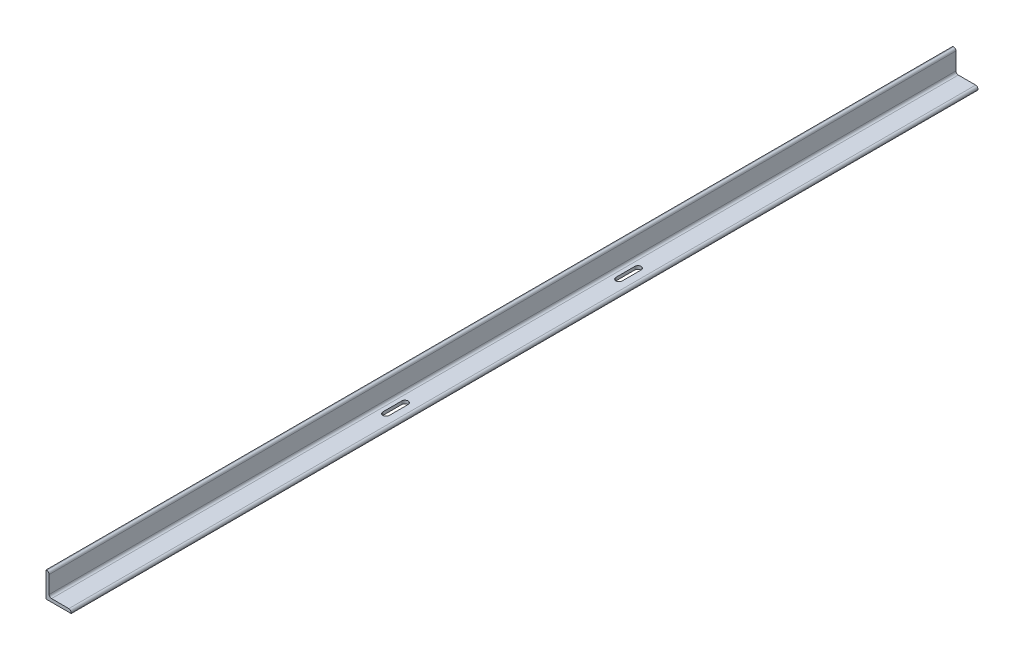
ISO-10303-21;
HEADER;
FILE_DESCRIPTION(('STEP AP214'),'2;1');
FILE_NAME('part.step','',(''),(''),'','','');
FILE_SCHEMA(('AUTOMOTIVE_DESIGN { 1 0 10303 214 1 1 1 1 }'));
ENDSEC;
DATA;
#1=APPLICATION_CONTEXT('core data for automotive mechanical design processes');
#2=APPLICATION_PROTOCOL_DEFINITION('international standard','automotive_design',2000,#1);
#3=PRODUCT_CONTEXT('',#1,'mechanical');
#4=PRODUCT('Part','Part','',(#3));
#5=PRODUCT_RELATED_PRODUCT_CATEGORY('part','',(#4));
#6=PRODUCT_DEFINITION_FORMATION('','',#4);
#7=PRODUCT_DEFINITION_CONTEXT('part definition',#1,'design');
#8=PRODUCT_DEFINITION('design','',#6,#7);
#9=PRODUCT_DEFINITION_SHAPE('','',#8);
#10=(LENGTH_UNIT() NAMED_UNIT(*) SI_UNIT(.MILLI.,.METRE.));
#11=(NAMED_UNIT(*) PLANE_ANGLE_UNIT() SI_UNIT($,.RADIAN.));
#12=(NAMED_UNIT(*) SI_UNIT($,.STERADIAN.) SOLID_ANGLE_UNIT());
#13=UNCERTAINTY_MEASURE_WITH_UNIT(LENGTH_MEASURE(1.E-05),#10,'distance_accuracy_value','');
#14=(GEOMETRIC_REPRESENTATION_CONTEXT(3) GLOBAL_UNCERTAINTY_ASSIGNED_CONTEXT((#13)) GLOBAL_UNIT_ASSIGNED_CONTEXT((#10,
#11,#12)) REPRESENTATION_CONTEXT('',''));
#15=CARTESIAN_POINT('',(0.,0.,0.));
#16=DIRECTION('',(0.,0.,1.));
#17=DIRECTION('',(1.,0.,0.));
#18=AXIS2_PLACEMENT_3D('',#15,#16,#17);
#19=CARTESIAN_POINT('',(50.8,0.,914.4));
#20=DIRECTION('',(0.,1.,0.));
#21=DIRECTION('',(0.,0.,1.));
#22=AXIS2_PLACEMENT_3D('',#19,#20,#21);
#23=PLANE('',#22);
#24=DIRECTION('',(0.,0.,-1.));
#25=VECTOR('',#24,1.);
#26=CARTESIAN_POINT('',(19.0499999999977,0.,254.));
#27=LINE('',#26,#25);
#28=CARTESIAN_POINT('',(19.0499999999977,0.,254.));
#29=VERTEX_POINT('',#28);
#30=CARTESIAN_POINT('',(19.0499999999981,0.,215.9));
#31=VERTEX_POINT('',#30);
#32=EDGE_CURVE('E157',#29,#31,#27,.T.);
#33=ORIENTED_EDGE('',*,*,#32,.F.);
#34=CARTESIAN_POINT('',(25.3999999999977,0.,254.));
#35=DIRECTION('',(0.,-1.,0.));
#36=DIRECTION('',(0.,0.,1.));
#37=AXIS2_PLACEMENT_3D('',#34,#35,#36);
#38=CIRCLE('',#37,6.35);
#39=CARTESIAN_POINT('',(31.7499999999978,0.,254.));
#40=VERTEX_POINT('',#39);
#41=EDGE_CURVE('E31',#40,#29,#38,.T.);
#42=ORIENTED_EDGE('',*,*,#41,.F.);
#43=DIRECTION('',(0.,0.,1.));
#44=VECTOR('',#43,1.);
#45=CARTESIAN_POINT('',(31.7499999999978,0.,254.));
#46=LINE('',#45,#44);
#47=CARTESIAN_POINT('',(31.7499999999981,0.,215.9));
#48=VERTEX_POINT('',#47);
#49=EDGE_CURVE('E143',#48,#40,#46,.T.);
#50=ORIENTED_EDGE('',*,*,#49,.F.);
#51=CARTESIAN_POINT('',(25.3999999999981,0.,215.9));
#52=DIRECTION('',(0.,-1.,0.));
#53=DIRECTION('',(0.,0.,1.));
#54=AXIS2_PLACEMENT_3D('',#51,#52,#53);
#55=CIRCLE('',#54,6.35);
#56=EDGE_CURVE('E163',#31,#48,#55,.T.);
#57=ORIENTED_EDGE('',*,*,#56,.F.);
#58=EDGE_LOOP('',(#33,#42,#50,#57));
#59=FACE_BOUND('',#58,.T.);
#60=DIRECTION('',(0.,0.,1.));
#61=VECTOR('',#60,1.);
#62=CARTESIAN_POINT('',(31.75,0.,-254.));
#63=LINE('',#62,#61);
#64=CARTESIAN_POINT('',(31.75,0.,-254.));
#65=VERTEX_POINT('',#64);
#66=CARTESIAN_POINT('',(31.75,0.,-215.9));
#67=VERTEX_POINT('',#66);
#68=EDGE_CURVE('E181',#65,#67,#63,.T.);
#69=ORIENTED_EDGE('',*,*,#68,.F.);
#70=CARTESIAN_POINT('',(25.4,0.,-254.));
#71=DIRECTION('',(0.,-1.,0.));
#72=DIRECTION('',(0.,0.,-1.));
#73=AXIS2_PLACEMENT_3D('',#70,#71,#72);
#74=CIRCLE('',#73,6.35);
#75=CARTESIAN_POINT('',(19.05,0.,-254.));
#76=VERTEX_POINT('',#75);
#77=EDGE_CURVE('E179',#76,#65,#74,.T.);
#78=ORIENTED_EDGE('',*,*,#77,.F.);
#79=DIRECTION('',(0.,0.,-1.));
#80=VECTOR('',#79,1.);
#81=CARTESIAN_POINT('',(19.05,0.,-254.));
#82=LINE('',#81,#80);
#83=CARTESIAN_POINT('',(19.05,0.,-215.9));
#84=VERTEX_POINT('',#83);
#85=EDGE_CURVE('E187',#84,#76,#82,.T.);
#86=ORIENTED_EDGE('',*,*,#85,.F.);
#87=CARTESIAN_POINT('',(25.4,0.,-215.9));
#88=DIRECTION('',(0.,-1.,0.));
#89=DIRECTION('',(0.,0.,-1.));
#90=AXIS2_PLACEMENT_3D('',#87,#88,#89);
#91=CIRCLE('',#90,6.35);
#92=EDGE_CURVE('E184',#67,#84,#91,.T.);
#93=ORIENTED_EDGE('',*,*,#92,.F.);
#94=EDGE_LOOP('',(#69,#78,#86,#93));
#95=FACE_BOUND('',#94,.T.);
#96=DIRECTION('',(1.,0.,0.));
#97=VECTOR('',#96,1.);
#98=CARTESIAN_POINT('',(50.8,0.,-914.4));
#99=LINE('',#98,#97);
#100=CARTESIAN_POINT('',(0.,0.,-914.4));
#101=VERTEX_POINT('',#100);
#102=CARTESIAN_POINT('',(50.8,0.,-914.4));
#103=VERTEX_POINT('',#102);
#104=EDGE_CURVE('E202',#101,#103,#99,.T.);
#105=ORIENTED_EDGE('',*,*,#104,.T.);
#106=DIRECTION('',(0.,0.,-1.));
#107=VECTOR('',#106,1.);
#108=CARTESIAN_POINT('',(50.8,0.,914.4));
#109=LINE('',#108,#107);
#110=CARTESIAN_POINT('',(50.8,0.,914.4));
#111=VERTEX_POINT('',#110);
#112=EDGE_CURVE('E11',#111,#103,#109,.T.);
#113=ORIENTED_EDGE('',*,*,#112,.F.);
#114=DIRECTION('',(1.,0.,0.));
#115=VECTOR('',#114,1.);
#116=CARTESIAN_POINT('',(50.8,0.,914.4));
#117=LINE('',#116,#115);
#118=CARTESIAN_POINT('',(0.,0.,914.4));
#119=VERTEX_POINT('',#118);
#120=EDGE_CURVE('E203',#119,#111,#117,.T.);
#121=ORIENTED_EDGE('',*,*,#120,.F.);
#122=DIRECTION('',(0.,0.,-1.));
#123=VECTOR('',#122,1.);
#124=CARTESIAN_POINT('',(0.,0.,914.4));
#125=LINE('',#124,#123);
#126=EDGE_CURVE('E223',#119,#101,#125,.T.);
#127=ORIENTED_EDGE('',*,*,#126,.T.);
#128=EDGE_LOOP('',(#105,#113,#121,#127));
#129=FACE_BOUND('',#128,.T.);
#130=ADVANCED_FACE('F17',(#59,#95,#129),#23,.F.);
#131=CARTESIAN_POINT('',(50.8,1.59258,914.4));
#132=DIRECTION('',(-1.,0.,0.));
#133=DIRECTION('',(0.,0.,1.));
#134=AXIS2_PLACEMENT_3D('',#131,#132,#133);
#135=PLANE('',#134);
#136=DIRECTION('',(0.,1.,0.));
#137=VECTOR('',#136,1.);
#138=CARTESIAN_POINT('',(50.8,1.59258,-914.4));
#139=LINE('',#138,#137);
#140=CARTESIAN_POINT('',(50.8,1.59258,-914.4));
#141=VERTEX_POINT('',#140);
#142=EDGE_CURVE('E226',#103,#141,#139,.T.);
#143=ORIENTED_EDGE('',*,*,#142,.T.);
#144=DIRECTION('',(0.,0.,-1.));
#145=VECTOR('',#144,1.);
#146=CARTESIAN_POINT('',(50.8,1.59258,914.4));
#147=LINE('',#146,#145);
#148=CARTESIAN_POINT('',(50.8,1.59258,914.4));
#149=VERTEX_POINT('',#148);
#150=EDGE_CURVE('E24',#149,#141,#147,.T.);
#151=ORIENTED_EDGE('',*,*,#150,.F.);
#152=DIRECTION('',(0.,1.,0.));
#153=VECTOR('',#152,1.);
#154=CARTESIAN_POINT('',(50.8,1.59258,914.4));
#155=LINE('',#154,#153);
#156=EDGE_CURVE('E206',#111,#149,#155,.T.);
#157=ORIENTED_EDGE('',*,*,#156,.F.);
#158=ORIENTED_EDGE('',*,*,#112,.T.);
#159=EDGE_LOOP('',(#143,#151,#157,#158));
#160=FACE_BOUND('',#159,.T.);
#161=ADVANCED_FACE('F287',(#160),#135,.F.);
#162=CARTESIAN_POINT('',(46.04258,1.59258,914.4));
#163=DIRECTION('',(0.,0.,-1.));
#164=DIRECTION('',(-1.,0.,0.));
#165=AXIS2_PLACEMENT_3D('',#162,#163,#164);
#166=CYLINDRICAL_SURFACE('',#165,4.75742);
#167=CARTESIAN_POINT('',(46.04258,1.59258,-914.4));
#168=DIRECTION('',(0.,0.,1.));
#169=DIRECTION('',(1.,0.,0.));
#170=AXIS2_PLACEMENT_3D('',#167,#168,#169);
#171=CIRCLE('',#170,4.75742);
#172=CARTESIAN_POINT('',(46.04258,6.35,-914.4));
#173=VERTEX_POINT('',#172);
#174=EDGE_CURVE('E228',#141,#173,#171,.T.);
#175=ORIENTED_EDGE('',*,*,#174,.T.);
#176=DIRECTION('',(0.,0.,-1.));
#177=VECTOR('',#176,1.);
#178=CARTESIAN_POINT('',(46.04258,6.35,914.4));
#179=LINE('',#178,#177);
#180=CARTESIAN_POINT('',(46.04258,6.35,914.4));
#181=VERTEX_POINT('',#180);
#182=EDGE_CURVE('E258',#181,#173,#179,.T.);
#183=ORIENTED_EDGE('',*,*,#182,.F.);
#184=CARTESIAN_POINT('',(46.04258,1.59258,914.4));
#185=DIRECTION('',(0.,0.,1.));
#186=DIRECTION('',(1.,0.,0.));
#187=AXIS2_PLACEMENT_3D('',#184,#185,#186);
#188=CIRCLE('',#187,4.75742);
#189=EDGE_CURVE('E209',#149,#181,#188,.T.);
#190=ORIENTED_EDGE('',*,*,#189,.F.);
#191=ORIENTED_EDGE('',*,*,#150,.T.);
#192=EDGE_LOOP('',(#175,#183,#190,#191));
#193=FACE_BOUND('',#192,.T.);
#194=ADVANCED_FACE('F265',(#193),#166,.T.);
#195=CARTESIAN_POINT('',(11.1125,6.35,914.4));
#196=DIRECTION('',(0.,-1.,0.));
#197=DIRECTION('',(0.,0.,-1.));
#198=AXIS2_PLACEMENT_3D('',#195,#196,#197);
#199=PLANE('',#198);
#200=DIRECTION('',(0.,0.,-1.));
#201=VECTOR('',#200,1.);
#202=CARTESIAN_POINT('',(31.7499999999978,6.35,254.));
#203=LINE('',#202,#201);
#204=CARTESIAN_POINT('',(31.7499999999978,6.35,254.));
#205=VERTEX_POINT('',#204);
#206=CARTESIAN_POINT('',(31.7499999999981,6.35,215.9));
#207=VERTEX_POINT('',#206);
#208=EDGE_CURVE('E155',#205,#207,#203,.T.);
#209=ORIENTED_EDGE('',*,*,#208,.F.);
#210=CARTESIAN_POINT('',(25.3999999999977,6.35,254.));
#211=DIRECTION('',(0.,-1.,0.));
#212=DIRECTION('',(0.,0.,-1.));
#213=AXIS2_PLACEMENT_3D('',#210,#211,#212);
#214=CIRCLE('',#213,6.35);
#215=CARTESIAN_POINT('',(19.0499999999977,6.35,254.));
#216=VERTEX_POINT('',#215);
#217=EDGE_CURVE('E137',#216,#205,#214,.F.);
#218=ORIENTED_EDGE('',*,*,#217,.F.);
#219=DIRECTION('',(0.,0.,1.));
#220=VECTOR('',#219,1.);
#221=CARTESIAN_POINT('',(19.0499999999977,6.35,254.));
#222=LINE('',#221,#220);
#223=CARTESIAN_POINT('',(19.0499999999981,6.35,215.9));
#224=VERTEX_POINT('',#223);
#225=EDGE_CURVE('E146',#224,#216,#222,.T.);
#226=ORIENTED_EDGE('',*,*,#225,.F.);
#227=CARTESIAN_POINT('',(25.3999999999981,6.35,215.9));
#228=DIRECTION('',(0.,-1.,0.));
#229=DIRECTION('',(0.,0.,-1.));
#230=AXIS2_PLACEMENT_3D('',#227,#228,#229);
#231=CIRCLE('',#230,6.35);
#232=EDGE_CURVE('E39',#207,#224,#231,.F.);
#233=ORIENTED_EDGE('',*,*,#232,.F.);
#234=EDGE_LOOP('',(#209,#218,#226,#233));
#235=FACE_BOUND('',#234,.T.);
#236=DIRECTION('',(0.,0.,1.));
#237=VECTOR('',#236,1.);
#238=CARTESIAN_POINT('',(19.05,6.35,-254.));
#239=LINE('',#238,#237);
#240=CARTESIAN_POINT('',(19.05,6.35,-254.));
#241=VERTEX_POINT('',#240);
#242=CARTESIAN_POINT('',(19.05,6.35,-215.9));
#243=VERTEX_POINT('',#242);
#244=EDGE_CURVE('E173',#241,#243,#239,.T.);
#245=ORIENTED_EDGE('',*,*,#244,.F.);
#246=CARTESIAN_POINT('',(25.4,6.35,-254.));
#247=DIRECTION('',(0.,-1.,0.));
#248=DIRECTION('',(0.,0.,-1.));
#249=AXIS2_PLACEMENT_3D('',#246,#247,#248);
#250=CIRCLE('',#249,6.35);
#251=CARTESIAN_POINT('',(31.75,6.35,-254.));
#252=VERTEX_POINT('',#251);
#253=EDGE_CURVE('E176',#252,#241,#250,.F.);
#254=ORIENTED_EDGE('',*,*,#253,.F.);
#255=DIRECTION('',(0.,0.,-1.));
#256=VECTOR('',#255,1.);
#257=CARTESIAN_POINT('',(31.75,6.35,-254.));
#258=LINE('',#257,#256);
#259=CARTESIAN_POINT('',(31.75,6.35,-215.9));
#260=VERTEX_POINT('',#259);
#261=EDGE_CURVE('E193',#260,#252,#258,.T.);
#262=ORIENTED_EDGE('',*,*,#261,.F.);
#263=CARTESIAN_POINT('',(25.4,6.35,-215.9));
#264=DIRECTION('',(0.,-1.,0.));
#265=DIRECTION('',(0.,0.,-1.));
#266=AXIS2_PLACEMENT_3D('',#263,#264,#265);
#267=CIRCLE('',#266,6.35);
#268=EDGE_CURVE('E149',#243,#260,#267,.F.);
#269=ORIENTED_EDGE('',*,*,#268,.F.);
#270=EDGE_LOOP('',(#245,#254,#262,#269));
#271=FACE_BOUND('',#270,.T.);
#272=DIRECTION('',(-1.,0.,0.));
#273=VECTOR('',#272,1.);
#274=CARTESIAN_POINT('',(11.1125,6.35,-914.4));
#275=LINE('',#274,#273);
#276=CARTESIAN_POINT('',(11.1125,6.35,-914.4));
#277=VERTEX_POINT('',#276);
#278=EDGE_CURVE('E230',#173,#277,#275,.T.);
#279=ORIENTED_EDGE('',*,*,#278,.T.);
#280=DIRECTION('',(0.,0.,-1.));
#281=VECTOR('',#280,1.);
#282=CARTESIAN_POINT('',(11.1125,6.35,914.4));
#283=LINE('',#282,#281);
#284=CARTESIAN_POINT('',(11.1125,6.35,914.4));
#285=VERTEX_POINT('',#284);
#286=EDGE_CURVE('E255',#285,#277,#283,.T.);
#287=ORIENTED_EDGE('',*,*,#286,.F.);
#288=DIRECTION('',(-1.,0.,0.));
#289=VECTOR('',#288,1.);
#290=CARTESIAN_POINT('',(11.1125,6.35,914.4));
#291=LINE('',#290,#289);
#292=EDGE_CURVE('E211',#181,#285,#291,.T.);
#293=ORIENTED_EDGE('',*,*,#292,.F.);
#294=ORIENTED_EDGE('',*,*,#182,.T.);
#295=EDGE_LOOP('',(#279,#287,#293,#294));
#296=FACE_BOUND('',#295,.T.);
#297=ADVANCED_FACE('F152',(#235,#271,#296),#199,.F.);
#298=CARTESIAN_POINT('',(11.1125,11.1125,914.4));
#299=DIRECTION('',(0.,0.,-1.));
#300=DIRECTION('',(-1.,0.,0.));
#301=AXIS2_PLACEMENT_3D('',#298,#299,#300);
#302=CYLINDRICAL_SURFACE('',#301,4.7625);
#303=CARTESIAN_POINT('',(11.1125,11.1125,-914.4));
#304=DIRECTION('',(0.,0.,-1.));
#305=DIRECTION('',(-1.,0.,0.));
#306=AXIS2_PLACEMENT_3D('',#303,#304,#305);
#307=CIRCLE('',#306,4.7625);
#308=CARTESIAN_POINT('',(6.35,11.1125,-914.4));
#309=VERTEX_POINT('',#308);
#310=EDGE_CURVE('E232',#277,#309,#307,.T.);
#311=ORIENTED_EDGE('',*,*,#310,.T.);
#312=DIRECTION('',(0.,0.,-1.));
#313=VECTOR('',#312,1.);
#314=CARTESIAN_POINT('',(6.35,11.1125,914.4));
#315=LINE('',#314,#313);
#316=CARTESIAN_POINT('',(6.35,11.1125,914.4));
#317=VERTEX_POINT('',#316);
#318=EDGE_CURVE('E252',#317,#309,#315,.T.);
#319=ORIENTED_EDGE('',*,*,#318,.F.);
#320=CARTESIAN_POINT('',(11.1125,11.1125,914.4));
#321=DIRECTION('',(0.,0.,-1.));
#322=DIRECTION('',(-1.,0.,0.));
#323=AXIS2_PLACEMENT_3D('',#320,#321,#322);
#324=CIRCLE('',#323,4.7625);
#325=EDGE_CURVE('E213',#285,#317,#324,.T.);
#326=ORIENTED_EDGE('',*,*,#325,.F.);
#327=ORIENTED_EDGE('',*,*,#286,.T.);
#328=EDGE_LOOP('',(#311,#319,#326,#327));
#329=FACE_BOUND('',#328,.T.);
#330=ADVANCED_FACE('F279',(#329),#302,.F.);
#331=CARTESIAN_POINT('',(6.35,46.04258,914.4));
#332=DIRECTION('',(-1.,0.,0.));
#333=DIRECTION('',(0.,-1.,0.));
#334=AXIS2_PLACEMENT_3D('',#331,#332,#333);
#335=PLANE('',#334);
#336=DIRECTION('',(0.,1.,0.));
#337=VECTOR('',#336,1.);
#338=CARTESIAN_POINT('',(6.35,46.04258,-914.4));
#339=LINE('',#338,#337);
#340=CARTESIAN_POINT('',(6.35,46.04258,-914.4));
#341=VERTEX_POINT('',#340);
#342=EDGE_CURVE('E234',#309,#341,#339,.T.);
#343=ORIENTED_EDGE('',*,*,#342,.T.);
#344=DIRECTION('',(0.,0.,-1.));
#345=VECTOR('',#344,1.);
#346=CARTESIAN_POINT('',(6.35,46.04258,914.4));
#347=LINE('',#346,#345);
#348=CARTESIAN_POINT('',(6.35,46.04258,914.4));
#349=VERTEX_POINT('',#348);
#350=EDGE_CURVE('E249',#349,#341,#347,.T.);
#351=ORIENTED_EDGE('',*,*,#350,.F.);
#352=DIRECTION('',(0.,1.,0.));
#353=VECTOR('',#352,1.);
#354=CARTESIAN_POINT('',(6.35,46.04258,914.4));
#355=LINE('',#354,#353);
#356=EDGE_CURVE('E215',#317,#349,#355,.T.);
#357=ORIENTED_EDGE('',*,*,#356,.F.);
#358=ORIENTED_EDGE('',*,*,#318,.T.);
#359=EDGE_LOOP('',(#343,#351,#357,#358));
#360=FACE_BOUND('',#359,.T.);
#361=ADVANCED_FACE('F305',(#360),#335,.F.);
#362=CARTESIAN_POINT('',(1.59258,46.04258,914.4));
#363=DIRECTION('',(0.,0.,-1.));
#364=DIRECTION('',(-1.,0.,0.));
#365=AXIS2_PLACEMENT_3D('',#362,#363,#364);
#366=CYLINDRICAL_SURFACE('',#365,4.75742);
#367=CARTESIAN_POINT('',(1.59258,46.04258,-914.4));
#368=DIRECTION('',(0.,0.,1.));
#369=DIRECTION('',(-1.,0.,0.));
#370=AXIS2_PLACEMENT_3D('',#367,#368,#369);
#371=CIRCLE('',#370,4.75742);
#372=CARTESIAN_POINT('',(1.59258,50.8,-914.4));
#373=VERTEX_POINT('',#372);
#374=EDGE_CURVE('E236',#341,#373,#371,.T.);
#375=ORIENTED_EDGE('',*,*,#374,.T.);
#376=DIRECTION('',(0.,0.,-1.));
#377=VECTOR('',#376,1.);
#378=CARTESIAN_POINT('',(1.59258,50.8,914.4));
#379=LINE('',#378,#377);
#380=CARTESIAN_POINT('',(1.59258,50.8,914.4));
#381=VERTEX_POINT('',#380);
#382=EDGE_CURVE('E246',#381,#373,#379,.T.);
#383=ORIENTED_EDGE('',*,*,#382,.F.);
#384=CARTESIAN_POINT('',(1.59258,46.04258,914.4));
#385=DIRECTION('',(0.,0.,1.));
#386=DIRECTION('',(-1.,0.,0.));
#387=AXIS2_PLACEMENT_3D('',#384,#385,#386);
#388=CIRCLE('',#387,4.75742);
#389=EDGE_CURVE('E217',#349,#381,#388,.T.);
#390=ORIENTED_EDGE('',*,*,#389,.F.);
#391=ORIENTED_EDGE('',*,*,#350,.T.);
#392=EDGE_LOOP('',(#375,#383,#390,#391));
#393=FACE_BOUND('',#392,.T.);
#394=ADVANCED_FACE('F303',(#393),#366,.T.);
#395=CARTESIAN_POINT('',(0.,50.8,914.4));
#396=DIRECTION('',(0.,-1.,0.));
#397=DIRECTION('',(0.,0.,-1.));
#398=AXIS2_PLACEMENT_3D('',#395,#396,#397);
#399=PLANE('',#398);
#400=DIRECTION('',(-1.,0.,0.));
#401=VECTOR('',#400,1.);
#402=CARTESIAN_POINT('',(0.,50.8,-914.4));
#403=LINE('',#402,#401);
#404=CARTESIAN_POINT('',(0.,50.8,-914.4));
#405=VERTEX_POINT('',#404);
#406=EDGE_CURVE('E238',#373,#405,#403,.T.);
#407=ORIENTED_EDGE('',*,*,#406,.T.);
#408=DIRECTION('',(0.,0.,-1.));
#409=VECTOR('',#408,1.);
#410=CARTESIAN_POINT('',(0.,50.8,914.4));
#411=LINE('',#410,#409);
#412=CARTESIAN_POINT('',(0.,50.8,914.4));
#413=VERTEX_POINT('',#412);
#414=EDGE_CURVE('E243',#413,#405,#411,.T.);
#415=ORIENTED_EDGE('',*,*,#414,.F.);
#416=DIRECTION('',(-1.,0.,0.));
#417=VECTOR('',#416,1.);
#418=CARTESIAN_POINT('',(0.,50.8,914.4));
#419=LINE('',#418,#417);
#420=EDGE_CURVE('E219',#381,#413,#419,.T.);
#421=ORIENTED_EDGE('',*,*,#420,.F.);
#422=ORIENTED_EDGE('',*,*,#382,.T.);
#423=EDGE_LOOP('',(#407,#415,#421,#422));
#424=FACE_BOUND('',#423,.T.);
#425=ADVANCED_FACE('F299',(#424),#399,.F.);
#426=CARTESIAN_POINT('',(0.,0.,914.4));
#427=DIRECTION('',(1.,0.,0.));
#428=DIRECTION('',(0.,1.,0.));
#429=AXIS2_PLACEMENT_3D('',#426,#427,#428);
#430=PLANE('',#429);
#431=DIRECTION('',(0.,-1.,0.));
#432=VECTOR('',#431,1.);
#433=CARTESIAN_POINT('',(0.,0.,-914.4));
#434=LINE('',#433,#432);
#435=EDGE_CURVE('E207',#405,#101,#434,.T.);
#436=ORIENTED_EDGE('',*,*,#435,.T.);
#437=ORIENTED_EDGE('',*,*,#126,.F.);
#438=DIRECTION('',(0.,-1.,0.));
#439=VECTOR('',#438,1.);
#440=CARTESIAN_POINT('',(0.,0.,914.4));
#441=LINE('',#440,#439);
#442=EDGE_CURVE('E221',#413,#119,#441,.T.);
#443=ORIENTED_EDGE('',*,*,#442,.F.);
#444=ORIENTED_EDGE('',*,*,#414,.T.);
#445=EDGE_LOOP('',(#436,#437,#443,#444));
#446=FACE_BOUND('',#445,.T.);
#447=ADVANCED_FACE('F294',(#446),#430,.F.);
#448=CARTESIAN_POINT('',(1.59258,46.04258,914.4));
#449=DIRECTION('',(0.,0.,-1.));
#450=DIRECTION('',(-1.,0.,0.));
#451=AXIS2_PLACEMENT_3D('',#448,#449,#450);
#452=PLANE('',#451);
#453=ORIENTED_EDGE('',*,*,#120,.T.);
#454=ORIENTED_EDGE('',*,*,#156,.T.);
#455=ORIENTED_EDGE('',*,*,#189,.T.);
#456=ORIENTED_EDGE('',*,*,#292,.T.);
#457=ORIENTED_EDGE('',*,*,#325,.T.);
#458=ORIENTED_EDGE('',*,*,#356,.T.);
#459=ORIENTED_EDGE('',*,*,#389,.T.);
#460=ORIENTED_EDGE('',*,*,#420,.T.);
#461=ORIENTED_EDGE('',*,*,#442,.T.);
#462=EDGE_LOOP('',(#453,#454,#455,#456,#457,#458,#459,#460,#461));
#463=FACE_BOUND('',#462,.T.);
#464=ADVANCED_FACE('F283',(#463),#452,.F.);
#465=CARTESIAN_POINT('',(1.59258,46.04258,-914.4));
#466=DIRECTION('',(0.,0.,-1.));
#467=DIRECTION('',(-1.,0.,0.));
#468=AXIS2_PLACEMENT_3D('',#465,#466,#467);
#469=PLANE('',#468);
#470=ORIENTED_EDGE('',*,*,#104,.F.);
#471=ORIENTED_EDGE('',*,*,#435,.F.);
#472=ORIENTED_EDGE('',*,*,#406,.F.);
#473=ORIENTED_EDGE('',*,*,#374,.F.);
#474=ORIENTED_EDGE('',*,*,#342,.F.);
#475=ORIENTED_EDGE('',*,*,#310,.F.);
#476=ORIENTED_EDGE('',*,*,#278,.F.);
#477=ORIENTED_EDGE('',*,*,#174,.F.);
#478=ORIENTED_EDGE('',*,*,#142,.F.);
#479=EDGE_LOOP('',(#470,#471,#472,#473,#474,#475,#476,#477,#478));
#480=FACE_BOUND('',#479,.T.);
#481=ADVANCED_FACE('F271',(#480),#469,.T.);
#482=CARTESIAN_POINT('',(25.4,50.801,-254.));
#483=DIRECTION('',(0.,-1.,0.));
#484=DIRECTION('',(0.,0.,-1.));
#485=AXIS2_PLACEMENT_3D('',#482,#483,#484);
#486=CYLINDRICAL_SURFACE('',#485,6.35);
#487=ORIENTED_EDGE('',*,*,#253,.T.);
#488=DIRECTION('',(0.,-1.,0.));
#489=VECTOR('',#488,1.);
#490=CARTESIAN_POINT('',(19.05,50.801,-254.));
#491=LINE('',#490,#489);
#492=EDGE_CURVE('E191',#241,#76,#491,.T.);
#493=ORIENTED_EDGE('',*,*,#492,.T.);
#494=ORIENTED_EDGE('',*,*,#77,.T.);
#495=DIRECTION('',(0.,-1.,0.));
#496=VECTOR('',#495,1.);
#497=CARTESIAN_POINT('',(31.75,50.801,-254.));
#498=LINE('',#497,#496);
#499=EDGE_CURVE('E190',#252,#65,#498,.T.);
#500=ORIENTED_EDGE('',*,*,#499,.F.);
#501=EDGE_LOOP('',(#487,#493,#494,#500));
#502=FACE_BOUND('',#501,.T.);
#503=ADVANCED_FACE('F334',(#502),#486,.F.);
#504=CARTESIAN_POINT('',(19.05,50.801,-254.));
#505=DIRECTION('',(-1.,0.,0.));
#506=DIRECTION('',(0.,0.,1.));
#507=AXIS2_PLACEMENT_3D('',#504,#505,#506);
#508=PLANE('',#507);
#509=ORIENTED_EDGE('',*,*,#244,.T.);
#510=DIRECTION('',(0.,-1.,0.));
#511=VECTOR('',#510,1.);
#512=CARTESIAN_POINT('',(19.05,50.801,-215.9));
#513=LINE('',#512,#511);
#514=EDGE_CURVE('E194',#243,#84,#513,.T.);
#515=ORIENTED_EDGE('',*,*,#514,.T.);
#516=ORIENTED_EDGE('',*,*,#85,.T.);
#517=ORIENTED_EDGE('',*,*,#492,.F.);
#518=EDGE_LOOP('',(#509,#515,#516,#517));
#519=FACE_BOUND('',#518,.T.);
#520=ADVANCED_FACE('F337',(#519),#508,.F.);
#521=CARTESIAN_POINT('',(25.4,50.801,-215.9));
#522=DIRECTION('',(0.,-1.,0.));
#523=DIRECTION('',(0.,0.,-1.));
#524=AXIS2_PLACEMENT_3D('',#521,#522,#523);
#525=CYLINDRICAL_SURFACE('',#524,6.35);
#526=ORIENTED_EDGE('',*,*,#268,.T.);
#527=DIRECTION('',(0.,-1.,0.));
#528=VECTOR('',#527,1.);
#529=CARTESIAN_POINT('',(31.75,50.801,-215.9));
#530=LINE('',#529,#528);
#531=EDGE_CURVE('E196',#260,#67,#530,.T.);
#532=ORIENTED_EDGE('',*,*,#531,.T.);
#533=ORIENTED_EDGE('',*,*,#92,.T.);
#534=ORIENTED_EDGE('',*,*,#514,.F.);
#535=EDGE_LOOP('',(#526,#532,#533,#534));
#536=FACE_BOUND('',#535,.T.);
#537=ADVANCED_FACE('F340',(#536),#525,.F.);
#538=CARTESIAN_POINT('',(31.75,50.801,-254.));
#539=DIRECTION('',(1.,0.,0.));
#540=DIRECTION('',(0.,0.,-1.));
#541=AXIS2_PLACEMENT_3D('',#538,#539,#540);
#542=PLANE('',#541);
#543=ORIENTED_EDGE('',*,*,#261,.T.);
#544=ORIENTED_EDGE('',*,*,#499,.T.);
#545=ORIENTED_EDGE('',*,*,#68,.T.);
#546=ORIENTED_EDGE('',*,*,#531,.F.);
#547=EDGE_LOOP('',(#543,#544,#545,#546));
#548=FACE_BOUND('',#547,.T.);
#549=ADVANCED_FACE('F330',(#548),#542,.F.);
#550=CARTESIAN_POINT('',(25.3999999999977,50.801,254.));
#551=DIRECTION('',(0.,-1.,0.));
#552=DIRECTION('',(0.,0.,-1.));
#553=AXIS2_PLACEMENT_3D('',#550,#551,#552);
#554=CYLINDRICAL_SURFACE('',#553,6.35);
#555=ORIENTED_EDGE('',*,*,#217,.T.);
#556=DIRECTION('',(0.,-1.,0.));
#557=VECTOR('',#556,1.);
#558=CARTESIAN_POINT('',(31.7499999999978,50.801,254.));
#559=LINE('',#558,#557);
#560=EDGE_CURVE('E150',#205,#40,#559,.T.);
#561=ORIENTED_EDGE('',*,*,#560,.T.);
#562=ORIENTED_EDGE('',*,*,#41,.T.);
#563=DIRECTION('',(0.,-1.,0.));
#564=VECTOR('',#563,1.);
#565=CARTESIAN_POINT('',(19.0499999999977,50.801,254.));
#566=LINE('',#565,#564);
#567=EDGE_CURVE('E133',#216,#29,#566,.T.);
#568=ORIENTED_EDGE('',*,*,#567,.F.);
#569=EDGE_LOOP('',(#555,#561,#562,#568));
#570=FACE_BOUND('',#569,.T.);
#571=ADVANCED_FACE('F135',(#570),#554,.F.);
#572=CARTESIAN_POINT('',(31.7499999999978,50.801,254.));
#573=DIRECTION('',(1.,0.,0.));
#574=DIRECTION('',(0.,0.,-1.));
#575=AXIS2_PLACEMENT_3D('',#572,#573,#574);
#576=PLANE('',#575);
#577=ORIENTED_EDGE('',*,*,#208,.T.);
#578=DIRECTION('',(0.,-1.,0.));
#579=VECTOR('',#578,1.);
#580=CARTESIAN_POINT('',(31.7499999999981,50.801,215.9));
#581=LINE('',#580,#579);
#582=EDGE_CURVE('E169',#207,#48,#581,.T.);
#583=ORIENTED_EDGE('',*,*,#582,.T.);
#584=ORIENTED_EDGE('',*,*,#49,.T.);
#585=ORIENTED_EDGE('',*,*,#560,.F.);
#586=EDGE_LOOP('',(#577,#583,#584,#585));
#587=FACE_BOUND('',#586,.T.);
#588=ADVANCED_FACE('F452',(#587),#576,.F.);
#589=CARTESIAN_POINT('',(25.3999999999981,50.801,215.9));
#590=DIRECTION('',(0.,-1.,0.));
#591=DIRECTION('',(0.,0.,-1.));
#592=AXIS2_PLACEMENT_3D('',#589,#590,#591);
#593=CYLINDRICAL_SURFACE('',#592,6.35);
#594=ORIENTED_EDGE('',*,*,#232,.T.);
#595=DIRECTION('',(0.,-1.,0.));
#596=VECTOR('',#595,1.);
#597=CARTESIAN_POINT('',(19.0499999999981,50.801,215.9));
#598=LINE('',#597,#596);
#599=EDGE_CURVE('E142',#224,#31,#598,.T.);
#600=ORIENTED_EDGE('',*,*,#599,.T.);
#601=ORIENTED_EDGE('',*,*,#56,.T.);
#602=ORIENTED_EDGE('',*,*,#582,.F.);
#603=EDGE_LOOP('',(#594,#600,#601,#602));
#604=FACE_BOUND('',#603,.T.);
#605=ADVANCED_FACE('F461',(#604),#593,.F.);
#606=CARTESIAN_POINT('',(19.0499999999977,50.801,254.));
#607=DIRECTION('',(-1.,0.,0.));
#608=DIRECTION('',(0.,0.,1.));
#609=AXIS2_PLACEMENT_3D('',#606,#607,#608);
#610=PLANE('',#609);
#611=ORIENTED_EDGE('',*,*,#225,.T.);
#612=ORIENTED_EDGE('',*,*,#567,.T.);
#613=ORIENTED_EDGE('',*,*,#32,.T.);
#614=ORIENTED_EDGE('',*,*,#599,.F.);
#615=EDGE_LOOP('',(#611,#612,#613,#614));
#616=FACE_BOUND('',#615,.T.);
#617=ADVANCED_FACE('F147',(#616),#610,.F.);
#618=CLOSED_SHELL('',(#130,#161,#194,#297,#330,#361,#394,#425,#447,#464,#481,#503,#520,#537,
#549,#571,#588,#605,#617));
#619=MANIFOLD_SOLID_BREP('B1',#618);
#620=ADVANCED_BREP_SHAPE_REPRESENTATION('',(#18,#619),#14);
#621=SHAPE_DEFINITION_REPRESENTATION(#9,#620);
ENDSEC;
END-ISO-10303-21;
